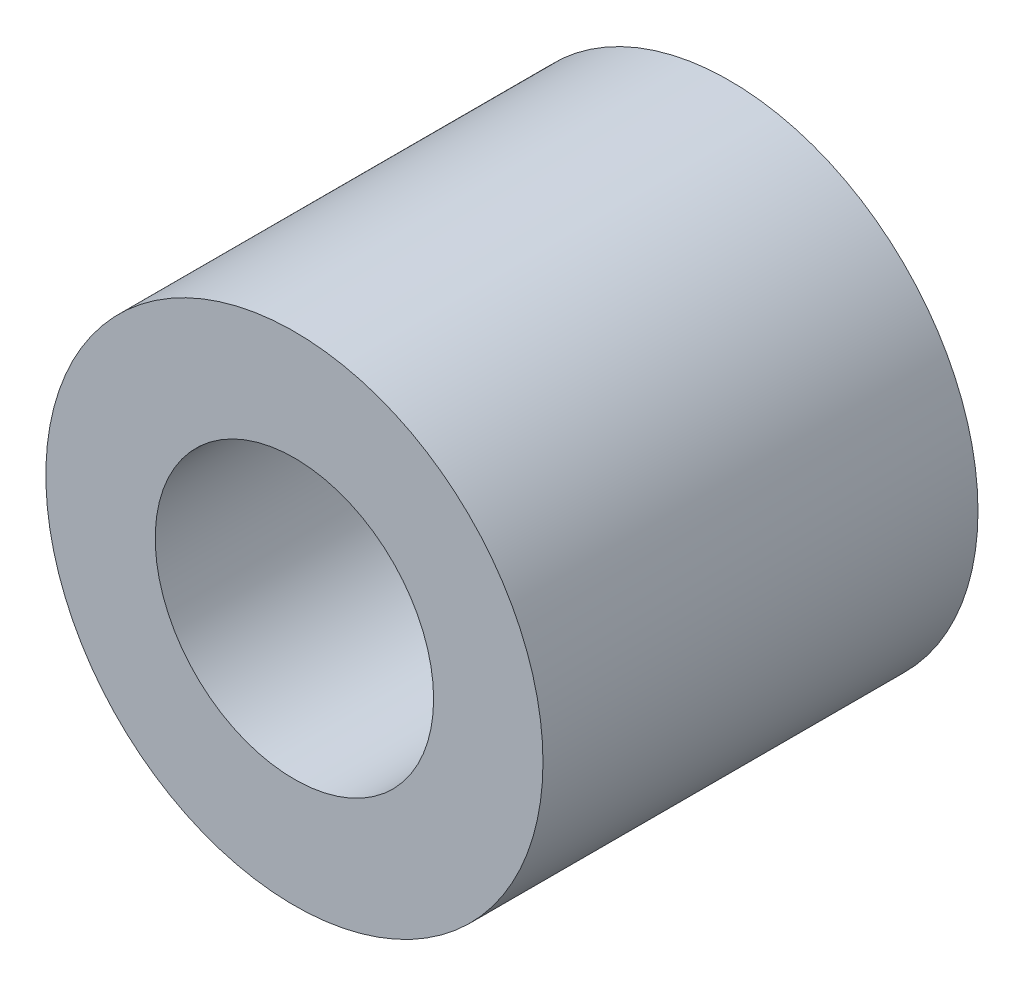
ISO-10303-21;
HEADER;
FILE_DESCRIPTION(('STEP AP214'),'2;1');
FILE_NAME('part.step','',(''),(''),'','','');
FILE_SCHEMA(('AUTOMOTIVE_DESIGN { 1 0 10303 214 1 1 1 1 }'));
ENDSEC;
DATA;
#1=APPLICATION_CONTEXT('core data for automotive mechanical design processes');
#2=APPLICATION_PROTOCOL_DEFINITION('international standard','automotive_design',2000,#1);
#3=PRODUCT_CONTEXT('',#1,'mechanical');
#4=PRODUCT('Part','Part','',(#3));
#5=PRODUCT_RELATED_PRODUCT_CATEGORY('part','',(#4));
#6=PRODUCT_DEFINITION_FORMATION('','',#4);
#7=PRODUCT_DEFINITION_CONTEXT('part definition',#1,'design');
#8=PRODUCT_DEFINITION('design','',#6,#7);
#9=PRODUCT_DEFINITION_SHAPE('','',#8);
#10=(LENGTH_UNIT() NAMED_UNIT(*) SI_UNIT(.MILLI.,.METRE.));
#11=(NAMED_UNIT(*) PLANE_ANGLE_UNIT() SI_UNIT($,.RADIAN.));
#12=(NAMED_UNIT(*) SI_UNIT($,.STERADIAN.) SOLID_ANGLE_UNIT());
#13=UNCERTAINTY_MEASURE_WITH_UNIT(LENGTH_MEASURE(1.E-05),#10,'distance_accuracy_value','');
#14=(GEOMETRIC_REPRESENTATION_CONTEXT(3) GLOBAL_UNCERTAINTY_ASSIGNED_CONTEXT((#13)) GLOBAL_UNIT_ASSIGNED_CONTEXT((#10,
#11,#12)) REPRESENTATION_CONTEXT('',''));
#15=CARTESIAN_POINT('',(0.,0.,0.));
#16=DIRECTION('',(0.,0.,1.));
#17=DIRECTION('',(1.,0.,0.));
#18=AXIS2_PLACEMENT_3D('',#15,#16,#17);
#19=CARTESIAN_POINT('',(0.,0.,2.778125));
#20=DIRECTION('',(0.,0.,1.));
#21=DIRECTION('',(1.,0.,0.));
#22=AXIS2_PLACEMENT_3D('',#19,#20,#21);
#23=PLANE('',#22);
#24=CARTESIAN_POINT('',(0.,0.,2.778125));
#25=DIRECTION('',(0.,0.,1.));
#26=DIRECTION('',(1.,0.,0.));
#27=AXIS2_PLACEMENT_3D('',#24,#25,#26);
#28=CIRCLE('',#27,3.175);
#29=CARTESIAN_POINT('',(3.175,0.,2.778125));
#30=VERTEX_POINT('',#29);
#31=EDGE_CURVE('E10',#30,#30,#28,.T.);
#32=ORIENTED_EDGE('',*,*,#31,.T.);
#33=EDGE_LOOP('',(#32));
#34=FACE_BOUND('',#33,.T.);
#35=CARTESIAN_POINT('',(0.,0.,2.778125));
#36=DIRECTION('',(0.,0.,1.));
#37=DIRECTION('',(1.,0.,0.));
#38=AXIS2_PLACEMENT_3D('',#35,#36,#37);
#39=CIRCLE('',#38,1.778);
#40=CARTESIAN_POINT('',(1.778,0.,2.778125));
#41=VERTEX_POINT('',#40);
#42=EDGE_CURVE('E41',#41,#41,#39,.T.);
#43=ORIENTED_EDGE('',*,*,#42,.F.);
#44=EDGE_LOOP('',(#43));
#45=FACE_BOUND('',#44,.T.);
#46=ADVANCED_FACE('F30',(#34,#45),#23,.T.);
#47=CARTESIAN_POINT('',(0.,0.,-2.778125));
#48=DIRECTION('',(0.,0.,1.));
#49=DIRECTION('',(1.,0.,0.));
#50=AXIS2_PLACEMENT_3D('',#47,#48,#49);
#51=PLANE('',#50);
#52=CARTESIAN_POINT('',(0.,0.,-2.778125));
#53=DIRECTION('',(0.,0.,1.));
#54=DIRECTION('',(1.,0.,0.));
#55=AXIS2_PLACEMENT_3D('',#52,#53,#54);
#56=CIRCLE('',#55,3.175);
#57=CARTESIAN_POINT('',(3.175,0.,-2.778125));
#58=VERTEX_POINT('',#57);
#59=EDGE_CURVE('E34',#58,#58,#56,.T.);
#60=ORIENTED_EDGE('',*,*,#59,.F.);
#61=EDGE_LOOP('',(#60));
#62=FACE_BOUND('',#61,.T.);
#63=CARTESIAN_POINT('',(0.,0.,-2.778125));
#64=DIRECTION('',(0.,0.,1.));
#65=DIRECTION('',(1.,0.,0.));
#66=AXIS2_PLACEMENT_3D('',#63,#64,#65);
#67=CIRCLE('',#66,1.778);
#68=CARTESIAN_POINT('',(1.778,0.,-2.778125));
#69=VERTEX_POINT('',#68);
#70=EDGE_CURVE('E43',#69,#69,#67,.T.);
#71=ORIENTED_EDGE('',*,*,#70,.T.);
#72=EDGE_LOOP('',(#71));
#73=FACE_BOUND('',#72,.T.);
#74=ADVANCED_FACE('F53',(#62,#73),#51,.F.);
#75=CARTESIAN_POINT('',(0.,0.,2.778125));
#76=DIRECTION('',(0.,0.,-1.));
#77=DIRECTION('',(-1.,0.,0.));
#78=AXIS2_PLACEMENT_3D('',#75,#76,#77);
#79=CYLINDRICAL_SURFACE('',#78,3.175);
#80=ORIENTED_EDGE('',*,*,#31,.F.);
#81=EDGE_LOOP('',(#80));
#82=FACE_BOUND('',#81,.T.);
#83=ORIENTED_EDGE('',*,*,#59,.T.);
#84=EDGE_LOOP('',(#83));
#85=FACE_BOUND('',#84,.T.);
#86=ADVANCED_FACE('F32',(#82,#85),#79,.T.);
#87=CARTESIAN_POINT('',(0.,0.,2.778125));
#88=DIRECTION('',(0.,0.,-1.));
#89=DIRECTION('',(-1.,0.,0.));
#90=AXIS2_PLACEMENT_3D('',#87,#88,#89);
#91=CYLINDRICAL_SURFACE('',#90,1.778);
#92=ORIENTED_EDGE('',*,*,#42,.T.);
#93=EDGE_LOOP('',(#92));
#94=FACE_BOUND('',#93,.T.);
#95=ORIENTED_EDGE('',*,*,#70,.F.);
#96=EDGE_LOOP('',(#95));
#97=FACE_BOUND('',#96,.T.);
#98=ADVANCED_FACE('F49',(#94,#97),#91,.F.);
#99=CLOSED_SHELL('',(#46,#74,#86,#98));
#100=MANIFOLD_SOLID_BREP('B2',#99);
#101=ADVANCED_BREP_SHAPE_REPRESENTATION('',(#18,#100),#14);
#102=SHAPE_DEFINITION_REPRESENTATION(#9,#101);
ENDSEC;
END-ISO-10303-21;
